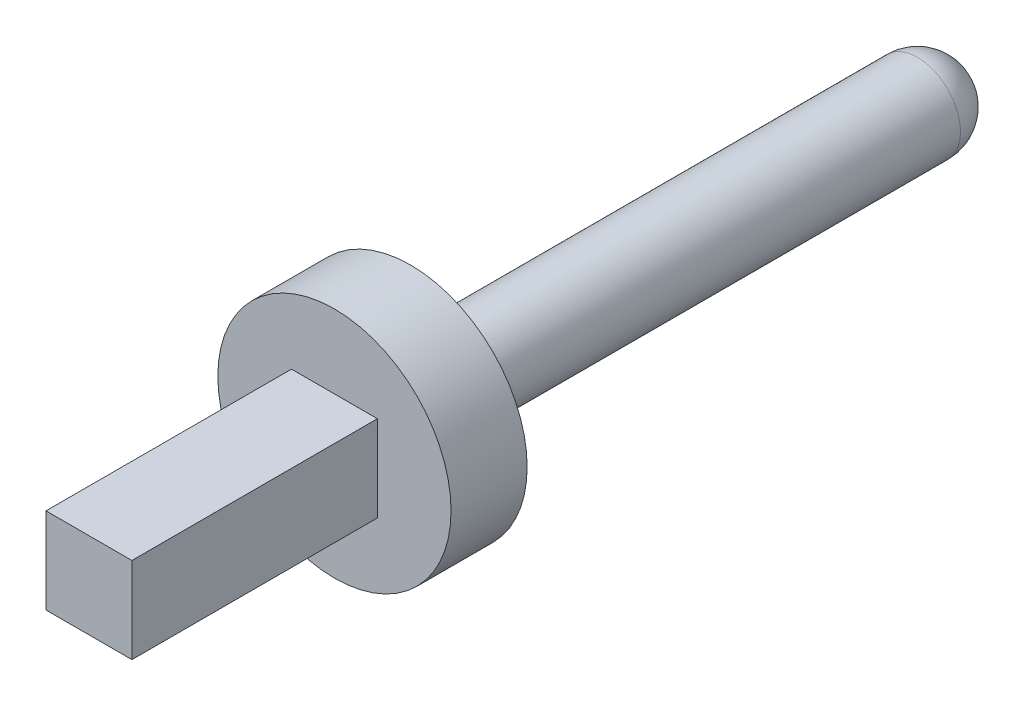
ISO-10303-21;
HEADER;
FILE_DESCRIPTION(('STEP AP214'),'2;1');
FILE_NAME('part.step','',(''),(''),'','','');
FILE_SCHEMA(('AUTOMOTIVE_DESIGN { 1 0 10303 214 1 1 1 1 }'));
ENDSEC;
DATA;
#1=APPLICATION_CONTEXT('core data for automotive mechanical design processes');
#2=APPLICATION_PROTOCOL_DEFINITION('international standard','automotive_design',2000,#1);
#3=PRODUCT_CONTEXT('',#1,'mechanical');
#4=PRODUCT('Part','Part','',(#3));
#5=PRODUCT_RELATED_PRODUCT_CATEGORY('part','',(#4));
#6=PRODUCT_DEFINITION_FORMATION('','',#4);
#7=PRODUCT_DEFINITION_CONTEXT('part definition',#1,'design');
#8=PRODUCT_DEFINITION('design','',#6,#7);
#9=PRODUCT_DEFINITION_SHAPE('','',#8);
#10=(LENGTH_UNIT() NAMED_UNIT(*) SI_UNIT(.MILLI.,.METRE.));
#11=(NAMED_UNIT(*) PLANE_ANGLE_UNIT() SI_UNIT($,.RADIAN.));
#12=(NAMED_UNIT(*) SI_UNIT($,.STERADIAN.) SOLID_ANGLE_UNIT());
#13=UNCERTAINTY_MEASURE_WITH_UNIT(LENGTH_MEASURE(1.E-05),#10,'distance_accuracy_value','');
#14=(GEOMETRIC_REPRESENTATION_CONTEXT(3) GLOBAL_UNCERTAINTY_ASSIGNED_CONTEXT((#13)) GLOBAL_UNIT_ASSIGNED_CONTEXT((#10,
#11,#12)) REPRESENTATION_CONTEXT('',''));
#15=CARTESIAN_POINT('',(0.,0.,0.));
#16=DIRECTION('',(0.,0.,1.));
#17=DIRECTION('',(1.,0.,0.));
#18=AXIS2_PLACEMENT_3D('',#15,#16,#17);
#19=CARTESIAN_POINT('',(5.,2.25,-0.62));
#20=DIRECTION('',(0.,0.,-1.));
#21=DIRECTION('',(-1.,0.,0.));
#22=AXIS2_PLACEMENT_3D('',#19,#20,#21);
#23=CYLINDRICAL_SURFACE('',#22,0.95);
#24=CARTESIAN_POINT('',(5.,2.25,-0.62));
#25=DIRECTION('',(0.,0.,1.));
#26=DIRECTION('',(0.,-1.,0.));
#27=AXIS2_PLACEMENT_3D('',#24,#25,#26);
#28=CIRCLE('',#27,0.95);
#29=CARTESIAN_POINT('',(5.,1.3,-0.62));
#30=VERTEX_POINT('',#29);
#31=EDGE_CURVE('E28',#30,#30,#28,.T.);
#32=ORIENTED_EDGE('',*,*,#31,.T.);
#33=EDGE_LOOP('',(#32));
#34=FACE_BOUND('',#33,.T.);
#35=CARTESIAN_POINT('',(5.,2.25,0.));
#36=DIRECTION('',(0.,0.,1.));
#37=DIRECTION('',(0.,-1.,0.));
#38=AXIS2_PLACEMENT_3D('',#35,#36,#37);
#39=CIRCLE('',#38,0.95);
#40=CARTESIAN_POINT('',(5.,1.3,0.));
#41=VERTEX_POINT('',#40);
#42=EDGE_CURVE('E109',#41,#41,#39,.T.);
#43=ORIENTED_EDGE('',*,*,#42,.F.);
#44=EDGE_LOOP('',(#43));
#45=FACE_BOUND('',#44,.T.);
#46=ADVANCED_FACE('F17',(#34,#45),#23,.T.);
#47=CARTESIAN_POINT('',(5.,2.25,-5.1));
#48=DIRECTION('',(0.,0.,-1.));
#49=DIRECTION('',(-1.,0.,0.));
#50=AXIS2_PLACEMENT_3D('',#47,#48,#49);
#51=CYLINDRICAL_SURFACE('',#50,0.35);
#52=CARTESIAN_POINT('',(5.,2.25,-4.75));
#53=DIRECTION('',(0.,0.,1.));
#54=DIRECTION('',(-1.,0.,0.));
#55=AXIS2_PLACEMENT_3D('',#52,#53,#54);
#56=CIRCLE('',#55,0.35);
#57=CARTESIAN_POINT('',(4.65,2.25,-4.75));
#58=VERTEX_POINT('',#57);
#59=EDGE_CURVE('E78',#58,#58,#56,.T.);
#60=ORIENTED_EDGE('',*,*,#59,.T.);
#61=EDGE_LOOP('',(#60));
#62=FACE_BOUND('',#61,.T.);
#63=CARTESIAN_POINT('',(5.,2.25,-0.62));
#64=DIRECTION('',(0.,0.,1.));
#65=DIRECTION('',(0.,-1.,0.));
#66=AXIS2_PLACEMENT_3D('',#63,#64,#65);
#67=CIRCLE('',#66,0.35);
#68=CARTESIAN_POINT('',(5.,1.9,-0.62));
#69=VERTEX_POINT('',#68);
#70=EDGE_CURVE('E11',#69,#69,#67,.T.);
#71=ORIENTED_EDGE('',*,*,#70,.F.);
#72=EDGE_LOOP('',(#71));
#73=FACE_BOUND('',#72,.T.);
#74=ADVANCED_FACE('F79',(#62,#73),#51,.T.);
#75=CARTESIAN_POINT('',(5.,2.25,-0.62));
#76=DIRECTION('',(0.,0.,1.));
#77=DIRECTION('',(-1.,0.,0.));
#78=AXIS2_PLACEMENT_3D('',#75,#76,#77);
#79=PLANE('',#78);
#80=ORIENTED_EDGE('',*,*,#70,.T.);
#81=EDGE_LOOP('',(#80));
#82=FACE_BOUND('',#81,.T.);
#83=ORIENTED_EDGE('',*,*,#31,.F.);
#84=EDGE_LOOP('',(#83));
#85=FACE_BOUND('',#84,.T.);
#86=ADVANCED_FACE('F160',(#82,#85),#79,.F.);
#87=CARTESIAN_POINT('',(5.,2.25,0.));
#88=DIRECTION('',(0.,0.,1.));
#89=DIRECTION('',(-1.,0.,0.));
#90=AXIS2_PLACEMENT_3D('',#87,#88,#89);
#91=PLANE('',#90);
#92=DIRECTION('',(-1.,0.,0.));
#93=VECTOR('',#92,1.);
#94=CARTESIAN_POINT('',(5.35,2.6,0.));
#95=LINE('',#94,#93);
#96=CARTESIAN_POINT('',(5.35,2.6,0.));
#97=VERTEX_POINT('',#96);
#98=CARTESIAN_POINT('',(4.65,2.6,0.));
#99=VERTEX_POINT('',#98);
#100=EDGE_CURVE('E116',#97,#99,#95,.T.);
#101=ORIENTED_EDGE('',*,*,#100,.F.);
#102=DIRECTION('',(0.,1.,0.));
#103=VECTOR('',#102,1.);
#104=CARTESIAN_POINT('',(5.35,1.9,0.));
#105=LINE('',#104,#103);
#106=CARTESIAN_POINT('',(5.35,1.9,0.));
#107=VERTEX_POINT('',#106);
#108=EDGE_CURVE('E95',#107,#97,#105,.T.);
#109=ORIENTED_EDGE('',*,*,#108,.F.);
#110=DIRECTION('',(1.,0.,0.));
#111=VECTOR('',#110,1.);
#112=CARTESIAN_POINT('',(4.65,1.9,0.));
#113=LINE('',#112,#111);
#114=CARTESIAN_POINT('',(4.65,1.9,0.));
#115=VERTEX_POINT('',#114);
#116=EDGE_CURVE('E21',#115,#107,#113,.T.);
#117=ORIENTED_EDGE('',*,*,#116,.F.);
#118=DIRECTION('',(0.,-1.,0.));
#119=VECTOR('',#118,1.);
#120=CARTESIAN_POINT('',(4.65,2.6,0.));
#121=LINE('',#120,#119);
#122=EDGE_CURVE('E101',#99,#115,#121,.T.);
#123=ORIENTED_EDGE('',*,*,#122,.F.);
#124=EDGE_LOOP('',(#101,#109,#117,#123));
#125=FACE_BOUND('',#124,.T.);
#126=ORIENTED_EDGE('',*,*,#42,.T.);
#127=EDGE_LOOP('',(#126));
#128=FACE_BOUND('',#127,.T.);
#129=ADVANCED_FACE('F136',(#125,#128),#91,.T.);
#130=CARTESIAN_POINT('',(5.35,2.6,0.));
#131=DIRECTION('',(0.,1.,0.));
#132=DIRECTION('',(0.,0.,-1.));
#133=AXIS2_PLACEMENT_3D('',#130,#131,#132);
#134=PLANE('',#133);
#135=DIRECTION('',(-1.,0.,0.));
#136=VECTOR('',#135,1.);
#137=CARTESIAN_POINT('',(5.35,2.6,2.));
#138=LINE('',#137,#136);
#139=CARTESIAN_POINT('',(5.35,2.6,2.));
#140=VERTEX_POINT('',#139);
#141=CARTESIAN_POINT('',(4.65,2.6,2.));
#142=VERTEX_POINT('',#141);
#143=EDGE_CURVE('E114',#140,#142,#138,.T.);
#144=ORIENTED_EDGE('',*,*,#143,.F.);
#145=DIRECTION('',(0.,0.,1.));
#146=VECTOR('',#145,1.);
#147=CARTESIAN_POINT('',(5.35,2.6,0.));
#148=LINE('',#147,#146);
#149=EDGE_CURVE('E84',#97,#140,#148,.T.);
#150=ORIENTED_EDGE('',*,*,#149,.F.);
#151=ORIENTED_EDGE('',*,*,#100,.T.);
#152=DIRECTION('',(0.,0.,1.));
#153=VECTOR('',#152,1.);
#154=CARTESIAN_POINT('',(4.65,2.6,0.));
#155=LINE('',#154,#153);
#156=EDGE_CURVE('E91',#99,#142,#155,.T.);
#157=ORIENTED_EDGE('',*,*,#156,.T.);
#158=EDGE_LOOP('',(#144,#150,#151,#157));
#159=FACE_BOUND('',#158,.T.);
#160=ADVANCED_FACE('F164',(#159),#134,.T.);
#161=CARTESIAN_POINT('',(5.35,2.6,2.));
#162=DIRECTION('',(0.,0.,1.));
#163=DIRECTION('',(-1.,0.,0.));
#164=AXIS2_PLACEMENT_3D('',#161,#162,#163);
#165=PLANE('',#164);
#166=DIRECTION('',(0.,1.,0.));
#167=VECTOR('',#166,1.);
#168=CARTESIAN_POINT('',(5.35,1.9,2.));
#169=LINE('',#168,#167);
#170=CARTESIAN_POINT('',(5.35,1.9,2.));
#171=VERTEX_POINT('',#170);
#172=EDGE_CURVE('E98',#171,#140,#169,.T.);
#173=ORIENTED_EDGE('',*,*,#172,.T.);
#174=ORIENTED_EDGE('',*,*,#143,.T.);
#175=DIRECTION('',(0.,-1.,0.));
#176=VECTOR('',#175,1.);
#177=CARTESIAN_POINT('',(4.65,2.6,2.));
#178=LINE('',#177,#176);
#179=CARTESIAN_POINT('',(4.65,1.9,2.));
#180=VERTEX_POINT('',#179);
#181=EDGE_CURVE('E83',#142,#180,#178,.T.);
#182=ORIENTED_EDGE('',*,*,#181,.T.);
#183=DIRECTION('',(1.,0.,0.));
#184=VECTOR('',#183,1.);
#185=CARTESIAN_POINT('',(4.65,1.9,2.));
#186=LINE('',#185,#184);
#187=EDGE_CURVE('E103',#180,#171,#186,.T.);
#188=ORIENTED_EDGE('',*,*,#187,.T.);
#189=EDGE_LOOP('',(#173,#174,#182,#188));
#190=FACE_BOUND('',#189,.T.);
#191=ADVANCED_FACE('F167',(#190),#165,.T.);
#192=CARTESIAN_POINT('',(4.65,1.9,0.));
#193=DIRECTION('',(0.,-1.,0.));
#194=DIRECTION('',(-1.,0.,0.));
#195=AXIS2_PLACEMENT_3D('',#192,#193,#194);
#196=PLANE('',#195);
#197=ORIENTED_EDGE('',*,*,#187,.F.);
#198=DIRECTION('',(0.,0.,1.));
#199=VECTOR('',#198,1.);
#200=CARTESIAN_POINT('',(4.65,1.9,0.));
#201=LINE('',#200,#199);
#202=EDGE_CURVE('E106',#115,#180,#201,.T.);
#203=ORIENTED_EDGE('',*,*,#202,.F.);
#204=ORIENTED_EDGE('',*,*,#116,.T.);
#205=DIRECTION('',(0.,0.,1.));
#206=VECTOR('',#205,1.);
#207=CARTESIAN_POINT('',(5.35,1.9,0.));
#208=LINE('',#207,#206);
#209=EDGE_CURVE('E113',#107,#171,#208,.T.);
#210=ORIENTED_EDGE('',*,*,#209,.T.);
#211=EDGE_LOOP('',(#197,#203,#204,#210));
#212=FACE_BOUND('',#211,.T.);
#213=ADVANCED_FACE('F19',(#212),#196,.T.);
#214=CARTESIAN_POINT('',(4.65,2.6,0.));
#215=DIRECTION('',(-1.,0.,0.));
#216=DIRECTION('',(0.,-1.,0.));
#217=AXIS2_PLACEMENT_3D('',#214,#215,#216);
#218=PLANE('',#217);
#219=ORIENTED_EDGE('',*,*,#181,.F.);
#220=ORIENTED_EDGE('',*,*,#156,.F.);
#221=ORIENTED_EDGE('',*,*,#122,.T.);
#222=ORIENTED_EDGE('',*,*,#202,.T.);
#223=EDGE_LOOP('',(#219,#220,#221,#222));
#224=FACE_BOUND('',#223,.T.);
#225=ADVANCED_FACE('F171',(#224),#218,.T.);
#226=CARTESIAN_POINT('',(5.,2.25,-4.75));
#227=DIRECTION('',(0.,0.,1.));
#228=DIRECTION('',(-1.,0.,0.));
#229=AXIS2_PLACEMENT_3D('',#226,#227,#228);
#230=SPHERICAL_SURFACE('',#229,0.35);
#231=ORIENTED_EDGE('',*,*,#59,.F.);
#232=EDGE_LOOP('',(#231));
#233=FACE_BOUND('',#232,.T.);
#234=ADVANCED_FACE('F173',(#233),#230,.T.);
#235=CARTESIAN_POINT('',(5.35,1.9,0.));
#236=DIRECTION('',(1.,0.,0.));
#237=DIRECTION('',(0.,0.,1.));
#238=AXIS2_PLACEMENT_3D('',#235,#236,#237);
#239=PLANE('',#238);
#240=ORIENTED_EDGE('',*,*,#172,.F.);
#241=ORIENTED_EDGE('',*,*,#209,.F.);
#242=ORIENTED_EDGE('',*,*,#108,.T.);
#243=ORIENTED_EDGE('',*,*,#149,.T.);
#244=EDGE_LOOP('',(#240,#241,#242,#243));
#245=FACE_BOUND('',#244,.T.);
#246=ADVANCED_FACE('F140',(#245),#239,.T.);
#247=CLOSED_SHELL('',(#46,#74,#86,#129,#160,#191,#213,#225,#234,#246));
#248=MANIFOLD_SOLID_BREP('B1',#247);
#249=ADVANCED_BREP_SHAPE_REPRESENTATION('',(#18,#248),#14);
#250=SHAPE_DEFINITION_REPRESENTATION(#9,#249);
ENDSEC;
END-ISO-10303-21;
